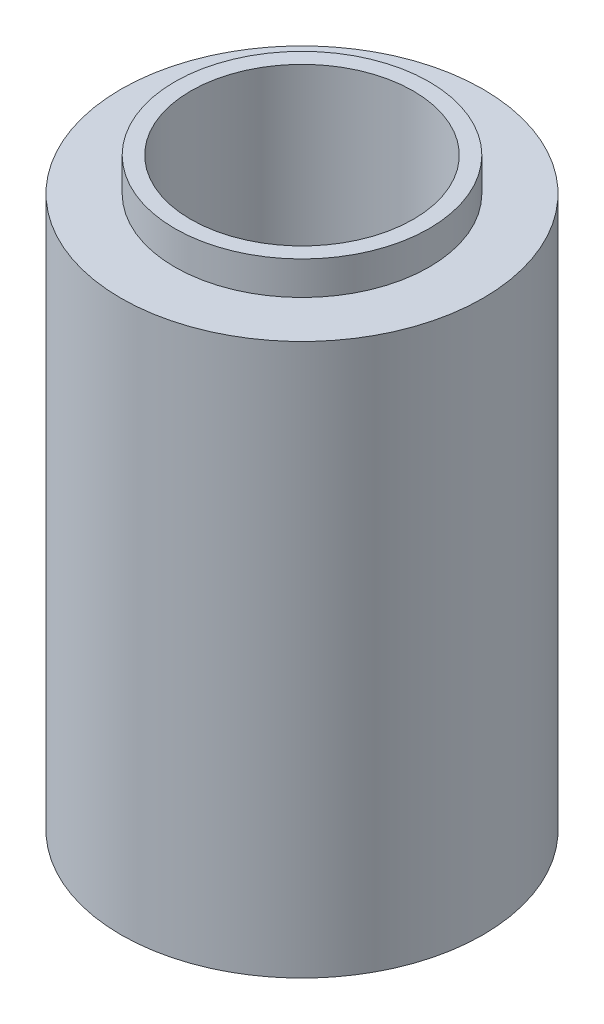
ISO-10303-21;
HEADER;
FILE_DESCRIPTION(('STEP AP214'),'2;1');
FILE_NAME('part.step','',(''),(''),'','','');
FILE_SCHEMA(('AUTOMOTIVE_DESIGN { 1 0 10303 214 1 1 1 1 }'));
ENDSEC;
DATA;
#1=APPLICATION_CONTEXT('core data for automotive mechanical design processes');
#2=APPLICATION_PROTOCOL_DEFINITION('international standard','automotive_design',2000,#1);
#3=PRODUCT_CONTEXT('',#1,'mechanical');
#4=PRODUCT('Part','Part','',(#3));
#5=PRODUCT_RELATED_PRODUCT_CATEGORY('part','',(#4));
#6=PRODUCT_DEFINITION_FORMATION('','',#4);
#7=PRODUCT_DEFINITION_CONTEXT('part definition',#1,'design');
#8=PRODUCT_DEFINITION('design','',#6,#7);
#9=PRODUCT_DEFINITION_SHAPE('','',#8);
#10=(LENGTH_UNIT() NAMED_UNIT(*) SI_UNIT(.MILLI.,.METRE.));
#11=(NAMED_UNIT(*) PLANE_ANGLE_UNIT() SI_UNIT($,.RADIAN.));
#12=(NAMED_UNIT(*) SI_UNIT($,.STERADIAN.) SOLID_ANGLE_UNIT());
#13=UNCERTAINTY_MEASURE_WITH_UNIT(LENGTH_MEASURE(1.E-05),#10,'distance_accuracy_value','');
#14=(GEOMETRIC_REPRESENTATION_CONTEXT(3) GLOBAL_UNCERTAINTY_ASSIGNED_CONTEXT((#13)) GLOBAL_UNIT_ASSIGNED_CONTEXT((#10,
#11,#12)) REPRESENTATION_CONTEXT('',''));
#15=CARTESIAN_POINT('',(0.,0.,0.));
#16=DIRECTION('',(0.,0.,1.));
#17=DIRECTION('',(1.,0.,0.));
#18=AXIS2_PLACEMENT_3D('',#15,#16,#17);
#19=CARTESIAN_POINT('',(0.,54.51,0.));
#20=DIRECTION('',(0.,1.,0.));
#21=DIRECTION('',(0.,0.,1.));
#22=AXIS2_PLACEMENT_3D('',#19,#20,#21);
#23=PLANE('',#22);
#24=CARTESIAN_POINT('',(0.,54.51,0.));
#25=DIRECTION('',(0.,1.,0.));
#26=DIRECTION('',(0.,0.,1.));
#27=AXIS2_PLACEMENT_3D('',#24,#25,#26);
#28=CIRCLE('',#27,17.9);
#29=CARTESIAN_POINT('',(0.,54.51,17.9));
#30=VERTEX_POINT('',#29);
#31=EDGE_CURVE('E10',#30,#30,#28,.T.);
#32=ORIENTED_EDGE('',*,*,#31,.T.);
#33=EDGE_LOOP('',(#32));
#34=FACE_BOUND('',#33,.T.);
#35=CARTESIAN_POINT('',(0.,54.51,0.));
#36=DIRECTION('',(0.,1.,0.));
#37=DIRECTION('',(0.,0.,1.));
#38=AXIS2_PLACEMENT_3D('',#35,#36,#37);
#39=CIRCLE('',#38,12.5735);
#40=CARTESIAN_POINT('',(0.,54.51,12.5735));
#41=VERTEX_POINT('',#40);
#42=EDGE_CURVE('E45',#41,#41,#39,.T.);
#43=ORIENTED_EDGE('',*,*,#42,.F.);
#44=EDGE_LOOP('',(#43));
#45=FACE_BOUND('',#44,.T.);
#46=ADVANCED_FACE('F30',(#34,#45),#23,.T.);
#47=CARTESIAN_POINT('',(0.,54.51,0.));
#48=DIRECTION('',(0.,-1.,0.));
#49=DIRECTION('',(0.,0.,-1.));
#50=AXIS2_PLACEMENT_3D('',#47,#48,#49);
#51=CYLINDRICAL_SURFACE('',#50,17.9);
#52=ORIENTED_EDGE('',*,*,#31,.F.);
#53=EDGE_LOOP('',(#52));
#54=FACE_BOUND('',#53,.T.);
#55=CARTESIAN_POINT('',(0.,0.,0.));
#56=DIRECTION('',(0.,1.,0.));
#57=DIRECTION('',(0.,0.,1.));
#58=AXIS2_PLACEMENT_3D('',#55,#56,#57);
#59=CIRCLE('',#58,17.9);
#60=CARTESIAN_POINT('',(0.,0.,17.9));
#61=VERTEX_POINT('',#60);
#62=EDGE_CURVE('E38',#61,#61,#59,.T.);
#63=ORIENTED_EDGE('',*,*,#62,.T.);
#64=EDGE_LOOP('',(#63));
#65=FACE_BOUND('',#64,.T.);
#66=ADVANCED_FACE('F32',(#54,#65),#51,.T.);
#67=CARTESIAN_POINT('',(0.,0.,0.));
#68=DIRECTION('',(0.,1.,0.));
#69=DIRECTION('',(0.,0.,1.));
#70=AXIS2_PLACEMENT_3D('',#67,#68,#69);
#71=PLANE('',#70);
#72=CARTESIAN_POINT('',(0.,0.,0.));
#73=DIRECTION('',(0.,-1.,0.));
#74=DIRECTION('',(0.,0.,-1.));
#75=AXIS2_PLACEMENT_3D('',#72,#73,#74);
#76=CIRCLE('',#75,11.);
#77=CARTESIAN_POINT('',(0.,0.,-11.));
#78=VERTEX_POINT('',#77);
#79=EDGE_CURVE('E50',#78,#78,#76,.T.);
#80=ORIENTED_EDGE('',*,*,#79,.F.);
#81=EDGE_LOOP('',(#80));
#82=FACE_BOUND('',#81,.T.);
#83=ORIENTED_EDGE('',*,*,#62,.F.);
#84=EDGE_LOOP('',(#83));
#85=FACE_BOUND('',#84,.T.);
#86=ADVANCED_FACE('F68',(#82,#85),#71,.F.);
#87=CARTESIAN_POINT('',(0.,57.81,0.));
#88=DIRECTION('',(0.,-1.,0.));
#89=DIRECTION('',(0.,0.,-1.));
#90=AXIS2_PLACEMENT_3D('',#87,#88,#89);
#91=CYLINDRICAL_SURFACE('',#90,12.5735);
#92=CARTESIAN_POINT('',(0.,57.81,0.));
#93=DIRECTION('',(0.,1.,0.));
#94=DIRECTION('',(0.,0.,1.));
#95=AXIS2_PLACEMENT_3D('',#92,#93,#94);
#96=CIRCLE('',#95,12.5735);
#97=CARTESIAN_POINT('',(0.,57.81,12.5735));
#98=VERTEX_POINT('',#97);
#99=EDGE_CURVE('E43',#98,#98,#96,.T.);
#100=ORIENTED_EDGE('',*,*,#99,.F.);
#101=EDGE_LOOP('',(#100));
#102=FACE_BOUND('',#101,.T.);
#103=ORIENTED_EDGE('',*,*,#42,.T.);
#104=EDGE_LOOP('',(#103));
#105=FACE_BOUND('',#104,.T.);
#106=ADVANCED_FACE('F62',(#102,#105),#91,.T.);
#107=CARTESIAN_POINT('',(0.,57.81,0.));
#108=DIRECTION('',(0.,1.,0.));
#109=DIRECTION('',(0.,0.,1.));
#110=AXIS2_PLACEMENT_3D('',#107,#108,#109);
#111=PLANE('',#110);
#112=CARTESIAN_POINT('',(0.,57.81,0.));
#113=DIRECTION('',(0.,1.,0.));
#114=DIRECTION('',(0.,0.,1.));
#115=AXIS2_PLACEMENT_3D('',#112,#113,#114);
#116=CIRCLE('',#115,11.);
#117=CARTESIAN_POINT('',(0.,57.81,11.));
#118=VERTEX_POINT('',#117);
#119=EDGE_CURVE('E34',#118,#118,#116,.T.);
#120=ORIENTED_EDGE('',*,*,#119,.F.);
#121=EDGE_LOOP('',(#120));
#122=FACE_BOUND('',#121,.T.);
#123=ORIENTED_EDGE('',*,*,#99,.T.);
#124=EDGE_LOOP('',(#123));
#125=FACE_BOUND('',#124,.T.);
#126=ADVANCED_FACE('F59',(#122,#125),#111,.T.);
#127=CARTESIAN_POINT('',(0.,59.3,0.));
#128=DIRECTION('',(0.,-1.,0.));
#129=DIRECTION('',(0.,0.,-1.));
#130=AXIS2_PLACEMENT_3D('',#127,#128,#129);
#131=CYLINDRICAL_SURFACE('',#130,11.);
#132=ORIENTED_EDGE('',*,*,#119,.T.);
#133=EDGE_LOOP('',(#132));
#134=FACE_BOUND('',#133,.T.);
#135=ORIENTED_EDGE('',*,*,#79,.T.);
#136=EDGE_LOOP('',(#135));
#137=FACE_BOUND('',#136,.T.);
#138=ADVANCED_FACE('F57',(#134,#137),#131,.F.);
#139=CLOSED_SHELL('',(#46,#66,#86,#106,#126,#138));
#140=MANIFOLD_SOLID_BREP('B2',#139);
#141=ADVANCED_BREP_SHAPE_REPRESENTATION('',(#18,#140),#14);
#142=SHAPE_DEFINITION_REPRESENTATION(#9,#141);
ENDSEC;
END-ISO-10303-21;
